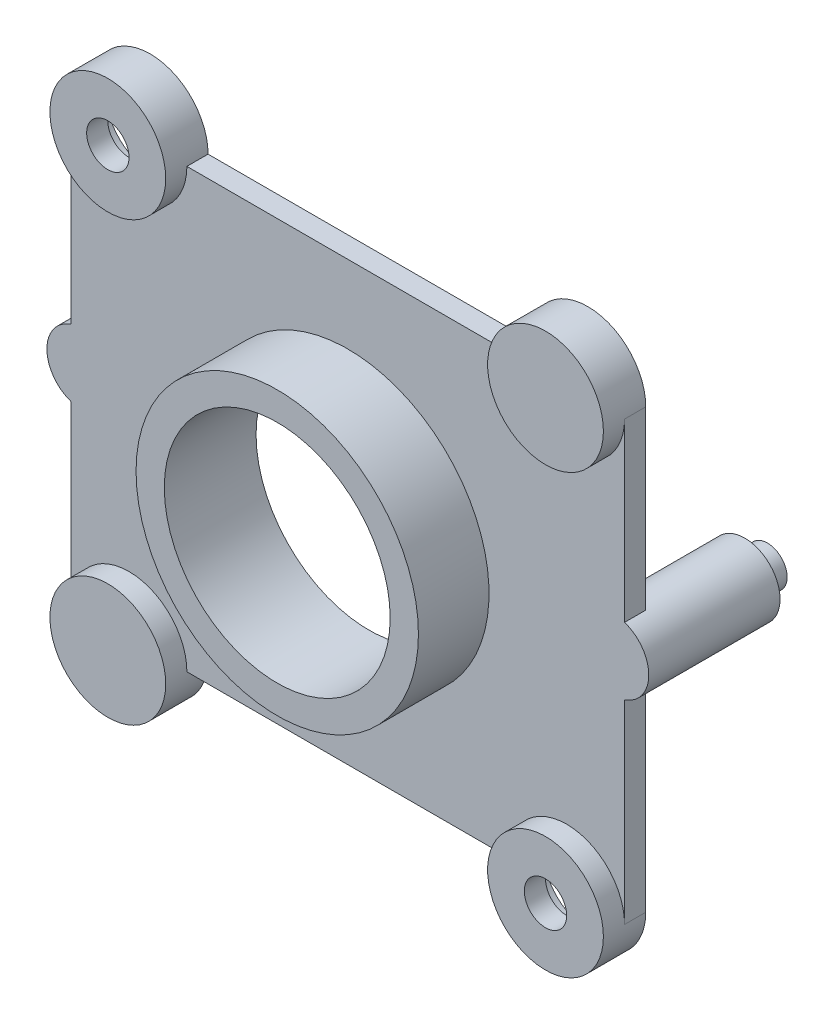
ISO-10303-21;
HEADER;
FILE_DESCRIPTION(('STEP AP214'),'2;1');
FILE_NAME('part.step','',(''),(''),'','','');
FILE_SCHEMA(('AUTOMOTIVE_DESIGN { 1 0 10303 214 1 1 1 1 }'));
ENDSEC;
DATA;
#1=APPLICATION_CONTEXT('core data for automotive mechanical design processes');
#2=APPLICATION_PROTOCOL_DEFINITION('international standard','automotive_design',2000,#1);
#3=PRODUCT_CONTEXT('',#1,'mechanical');
#4=PRODUCT('Part','Part','',(#3));
#5=PRODUCT_RELATED_PRODUCT_CATEGORY('part','',(#4));
#6=PRODUCT_DEFINITION_FORMATION('','',#4);
#7=PRODUCT_DEFINITION_CONTEXT('part definition',#1,'design');
#8=PRODUCT_DEFINITION('design','',#6,#7);
#9=PRODUCT_DEFINITION_SHAPE('','',#8);
#10=(LENGTH_UNIT() NAMED_UNIT(*) SI_UNIT(.MILLI.,.METRE.));
#11=(NAMED_UNIT(*) PLANE_ANGLE_UNIT() SI_UNIT($,.RADIAN.));
#12=(NAMED_UNIT(*) SI_UNIT($,.STERADIAN.) SOLID_ANGLE_UNIT());
#13=UNCERTAINTY_MEASURE_WITH_UNIT(LENGTH_MEASURE(1.E-05),#10,'distance_accuracy_value','');
#14=(GEOMETRIC_REPRESENTATION_CONTEXT(3) GLOBAL_UNCERTAINTY_ASSIGNED_CONTEXT((#13)) GLOBAL_UNIT_ASSIGNED_CONTEXT((#10,
#11,#12)) REPRESENTATION_CONTEXT('',''));
#15=CARTESIAN_POINT('',(0.,0.,0.));
#16=DIRECTION('',(0.,0.,1.));
#17=DIRECTION('',(1.,0.,0.));
#18=AXIS2_PLACEMENT_3D('',#15,#16,#17);
#19=CARTESIAN_POINT('',(-15.5,15.5,1.5));
#20=DIRECTION('',(0.,0.,-1.));
#21=DIRECTION('',(-1.,0.,0.));
#22=AXIS2_PLACEMENT_3D('',#19,#20,#21);
#23=PLANE('',#22);
#24=CARTESIAN_POINT('',(-15.5,-15.5,1.5));
#25=DIRECTION('',(0.,0.,1.));
#26=DIRECTION('',(1.,0.,0.));
#27=AXIS2_PLACEMENT_3D('',#24,#25,#26);
#28=CIRCLE('',#27,4.1);
#29=CARTESIAN_POINT('',(-11.4,-15.5,1.5));
#30=VERTEX_POINT('',#29);
#31=CARTESIAN_POINT('',(-19.6,-15.5,1.5));
#32=VERTEX_POINT('',#31);
#33=EDGE_CURVE('E225',#30,#32,#28,.T.);
#34=ORIENTED_EDGE('',*,*,#33,.F.);
#35=DIRECTION('',(1.,0.,0.));
#36=VECTOR('',#35,1.);
#37=CARTESIAN_POINT('',(11.4,-15.5,1.5));
#38=LINE('',#37,#36);
#39=CARTESIAN_POINT('',(11.4,-15.5,1.5));
#40=VERTEX_POINT('',#39);
#41=EDGE_CURVE('E298',#30,#40,#38,.T.);
#42=ORIENTED_EDGE('',*,*,#41,.T.);
#43=CARTESIAN_POINT('',(15.5,-15.5,1.5));
#44=DIRECTION('',(0.,0.,1.));
#45=DIRECTION('',(1.,0.,0.));
#46=AXIS2_PLACEMENT_3D('',#43,#44,#45);
#47=CIRCLE('',#46,4.1);
#48=CARTESIAN_POINT('',(19.6,-15.5,1.5));
#49=VERTEX_POINT('',#48);
#50=EDGE_CURVE('E231',#49,#40,#47,.T.);
#51=ORIENTED_EDGE('',*,*,#50,.F.);
#52=DIRECTION('',(0.,1.,0.));
#53=VECTOR('',#52,1.);
#54=CARTESIAN_POINT('',(19.6,-15.5,1.5));
#55=LINE('',#54,#53);
#56=CARTESIAN_POINT('',(19.6,-1.71605864665475,1.5));
#57=VERTEX_POINT('',#56);
#58=EDGE_CURVE('E300',#49,#57,#55,.T.);
#59=ORIENTED_EDGE('',*,*,#58,.T.);
#60=CARTESIAN_POINT('',(18.8134315520562,0.656979506578192,1.5));
#61=DIRECTION('',(0.,0.,1.));
#62=DIRECTION('',(-1.,0.,0.));
#63=AXIS2_PLACEMENT_3D('',#60,#61,#62);
#64=CIRCLE('',#63,2.5);
#65=CARTESIAN_POINT('',(19.6,3.03001765981114,1.5));
#66=VERTEX_POINT('',#65);
#67=EDGE_CURVE('E173',#57,#66,#64,.T.);
#68=ORIENTED_EDGE('',*,*,#67,.T.);
#69=DIRECTION('',(0.,1.,0.));
#70=VECTOR('',#69,1.);
#71=CARTESIAN_POINT('',(19.6,15.5,1.5));
#72=LINE('',#71,#70);
#73=CARTESIAN_POINT('',(19.6,15.5,1.5));
#74=VERTEX_POINT('',#73);
#75=EDGE_CURVE('E303',#66,#74,#72,.T.);
#76=ORIENTED_EDGE('',*,*,#75,.T.);
#77=CARTESIAN_POINT('',(15.5,15.5,1.5));
#78=DIRECTION('',(0.,0.,1.));
#79=DIRECTION('',(1.,0.,0.));
#80=AXIS2_PLACEMENT_3D('',#77,#78,#79);
#81=CIRCLE('',#80,4.1);
#82=CARTESIAN_POINT('',(11.4,15.5,1.5));
#83=VERTEX_POINT('',#82);
#84=EDGE_CURVE('E242',#83,#74,#81,.T.);
#85=ORIENTED_EDGE('',*,*,#84,.F.);
#86=DIRECTION('',(-1.,0.,0.));
#87=VECTOR('',#86,1.);
#88=CARTESIAN_POINT('',(-11.4,15.5,1.5));
#89=LINE('',#88,#87);
#90=CARTESIAN_POINT('',(-11.4,15.5,1.5));
#91=VERTEX_POINT('',#90);
#92=EDGE_CURVE('E305',#83,#91,#89,.T.);
#93=ORIENTED_EDGE('',*,*,#92,.T.);
#94=CARTESIAN_POINT('',(-15.5,15.5,1.5));
#95=DIRECTION('',(0.,0.,1.));
#96=DIRECTION('',(1.,0.,0.));
#97=AXIS2_PLACEMENT_3D('',#94,#95,#96);
#98=CIRCLE('',#97,4.1);
#99=CARTESIAN_POINT('',(-19.6,15.5,1.5));
#100=VERTEX_POINT('',#99);
#101=EDGE_CURVE('E38',#100,#91,#98,.T.);
#102=ORIENTED_EDGE('',*,*,#101,.F.);
#103=DIRECTION('',(0.,-1.,0.));
#104=VECTOR('',#103,1.);
#105=CARTESIAN_POINT('',(-19.6,15.5,1.5));
#106=LINE('',#105,#104);
#107=CARTESIAN_POINT('',(-19.6,1.71605864665475,1.5));
#108=VERTEX_POINT('',#107);
#109=EDGE_CURVE('E202',#100,#108,#106,.T.);
#110=ORIENTED_EDGE('',*,*,#109,.T.);
#111=CARTESIAN_POINT('',(-18.8134315520562,-0.65697950657819,1.5));
#112=DIRECTION('',(0.,0.,1.));
#113=DIRECTION('',(1.,0.,0.));
#114=AXIS2_PLACEMENT_3D('',#111,#112,#113);
#115=CIRCLE('',#114,2.5);
#116=CARTESIAN_POINT('',(-19.6,-3.03001765981113,1.5));
#117=VERTEX_POINT('',#116);
#118=EDGE_CURVE('E204',#108,#117,#115,.T.);
#119=ORIENTED_EDGE('',*,*,#118,.T.);
#120=DIRECTION('',(0.,-1.,0.));
#121=VECTOR('',#120,1.);
#122=CARTESIAN_POINT('',(-19.6,-15.5,1.5));
#123=LINE('',#122,#121);
#124=EDGE_CURVE('E296',#117,#32,#123,.T.);
#125=ORIENTED_EDGE('',*,*,#124,.T.);
#126=EDGE_LOOP('',(#34,#42,#51,#59,#68,#76,#85,#93,#102,#110,#119,#125));
#127=FACE_BOUND('',#126,.T.);
#128=CARTESIAN_POINT('',(0.,0.,1.5));
#129=DIRECTION('',(0.,0.,-1.));
#130=DIRECTION('',(-1.,0.,0.));
#131=AXIS2_PLACEMENT_3D('',#128,#129,#130);
#132=CIRCLE('',#131,10.);
#133=CARTESIAN_POINT('',(-10.,0.,1.5));
#134=VERTEX_POINT('',#133);
#135=EDGE_CURVE('E11',#134,#134,#132,.F.);
#136=ORIENTED_EDGE('',*,*,#135,.F.);
#137=EDGE_LOOP('',(#136));
#138=FACE_BOUND('',#137,.T.);
#139=ADVANCED_FACE('F30',(#127,#138),#23,.F.);
#140=CARTESIAN_POINT('',(-18.8134315520562,-0.65697950657819,-7.8));
#141=DIRECTION('',(0.,0.,-1.));
#142=DIRECTION('',(-1.,0.,0.));
#143=AXIS2_PLACEMENT_3D('',#140,#141,#142);
#144=PLANE('',#143);
#145=CARTESIAN_POINT('',(-18.8134315520562,-0.65697950657819,-7.8));
#146=DIRECTION('',(0.,0.,-1.));
#147=DIRECTION('',(-1.,0.,0.));
#148=AXIS2_PLACEMENT_3D('',#145,#146,#147);
#149=CIRCLE('',#148,2.5);
#150=CARTESIAN_POINT('',(-21.3134315520562,-0.65697950657819,-7.8));
#151=VERTEX_POINT('',#150);
#152=EDGE_CURVE('E220',#151,#151,#149,.T.);
#153=ORIENTED_EDGE('',*,*,#152,.T.);
#154=EDGE_LOOP('',(#153));
#155=FACE_BOUND('',#154,.T.);
#156=CARTESIAN_POINT('',(-18.8134315520562,-0.65697950657819,-7.8));
#157=DIRECTION('',(0.,0.,-1.));
#158=DIRECTION('',(-1.,0.,0.));
#159=AXIS2_PLACEMENT_3D('',#156,#157,#158);
#160=CIRCLE('',#159,1.4);
#161=CARTESIAN_POINT('',(-20.2134315520562,-0.65697950657819,-7.8));
#162=VERTEX_POINT('',#161);
#163=EDGE_CURVE('E489',#162,#162,#160,.T.);
#164=ORIENTED_EDGE('',*,*,#163,.F.);
#165=EDGE_LOOP('',(#164));
#166=FACE_BOUND('',#165,.T.);
#167=ADVANCED_FACE('F354',(#155,#166),#144,.T.);
#168=CARTESIAN_POINT('',(18.8134315520562,0.656979506578192,-7.8));
#169=DIRECTION('',(0.,0.,-1.));
#170=DIRECTION('',(-1.,0.,0.));
#171=AXIS2_PLACEMENT_3D('',#168,#169,#170);
#172=PLANE('',#171);
#173=CARTESIAN_POINT('',(18.8134315520562,0.656979506578192,-7.8));
#174=DIRECTION('',(0.,0.,-1.));
#175=DIRECTION('',(-1.,0.,0.));
#176=AXIS2_PLACEMENT_3D('',#173,#174,#175);
#177=CIRCLE('',#176,2.5);
#178=CARTESIAN_POINT('',(16.3134315520562,0.656979506578192,-7.8));
#179=VERTEX_POINT('',#178);
#180=EDGE_CURVE('E158',#179,#179,#177,.T.);
#181=ORIENTED_EDGE('',*,*,#180,.T.);
#182=EDGE_LOOP('',(#181));
#183=FACE_BOUND('',#182,.T.);
#184=CARTESIAN_POINT('',(18.8134315520562,0.656979506578192,-7.8));
#185=DIRECTION('',(0.,0.,-1.));
#186=DIRECTION('',(-1.,0.,0.));
#187=AXIS2_PLACEMENT_3D('',#184,#185,#186);
#188=CIRCLE('',#187,1.4);
#189=CARTESIAN_POINT('',(17.4134315520562,0.656979506578192,-7.8));
#190=VERTEX_POINT('',#189);
#191=EDGE_CURVE('E493',#190,#190,#188,.T.);
#192=ORIENTED_EDGE('',*,*,#191,.F.);
#193=EDGE_LOOP('',(#192));
#194=FACE_BOUND('',#193,.T.);
#195=ADVANCED_FACE('F359',(#183,#194),#172,.T.);
#196=CARTESIAN_POINT('',(-15.5,15.5,0.));
#197=DIRECTION('',(0.,0.,-1.));
#198=DIRECTION('',(-1.,0.,0.));
#199=AXIS2_PLACEMENT_3D('',#196,#197,#198);
#200=PLANE('',#199);
#201=CARTESIAN_POINT('',(0.,0.,0.));
#202=DIRECTION('',(0.,0.,-1.));
#203=DIRECTION('',(-1.,0.,0.));
#204=AXIS2_PLACEMENT_3D('',#201,#202,#203);
#205=CIRCLE('',#204,8.);
#206=CARTESIAN_POINT('',(-8.,0.,0.));
#207=VERTEX_POINT('',#206);
#208=EDGE_CURVE('E484',#207,#207,#205,.T.);
#209=ORIENTED_EDGE('',*,*,#208,.F.);
#210=EDGE_LOOP('',(#209));
#211=FACE_BOUND('',#210,.T.);
#212=DIRECTION('',(1.,0.,0.));
#213=VECTOR('',#212,1.);
#214=CARTESIAN_POINT('',(18.5935416596516,15.3,0.));
#215=LINE('',#214,#213);
#216=CARTESIAN_POINT('',(12.4064583403484,15.3,0.));
#217=VERTEX_POINT('',#216);
#218=CARTESIAN_POINT('',(18.5935416596516,15.3,0.));
#219=VERTEX_POINT('',#218);
#220=EDGE_CURVE('E262',#217,#219,#215,.T.);
#221=ORIENTED_EDGE('',*,*,#220,.T.);
#222=CARTESIAN_POINT('',(15.5,15.5,0.));
#223=DIRECTION('',(0.,0.,1.));
#224=DIRECTION('',(1.,0.,0.));
#225=AXIS2_PLACEMENT_3D('',#222,#223,#224);
#226=CIRCLE('',#225,3.1);
#227=EDGE_CURVE('E45',#219,#217,#226,.T.);
#228=ORIENTED_EDGE('',*,*,#227,.T.);
#229=EDGE_LOOP('',(#221,#228));
#230=FACE_BOUND('',#229,.T.);
#231=DIRECTION('',(-1.,0.,0.));
#232=VECTOR('',#231,1.);
#233=CARTESIAN_POINT('',(-12.4064583403484,-15.3,0.));
#234=LINE('',#233,#232);
#235=CARTESIAN_POINT('',(-12.4064583403484,-15.3,0.));
#236=VERTEX_POINT('',#235);
#237=CARTESIAN_POINT('',(-18.5935416596516,-15.3,0.));
#238=VERTEX_POINT('',#237);
#239=EDGE_CURVE('E281',#236,#238,#234,.T.);
#240=ORIENTED_EDGE('',*,*,#239,.T.);
#241=CARTESIAN_POINT('',(-15.5,-15.5,0.));
#242=DIRECTION('',(0.,0.,1.));
#243=DIRECTION('',(-1.,0.,0.));
#244=AXIS2_PLACEMENT_3D('',#241,#242,#243);
#245=CIRCLE('',#244,3.1);
#246=EDGE_CURVE('E53',#238,#236,#245,.T.);
#247=ORIENTED_EDGE('',*,*,#246,.T.);
#248=EDGE_LOOP('',(#240,#247));
#249=FACE_BOUND('',#248,.T.);
#250=CARTESIAN_POINT('',(15.5,-15.5,0.));
#251=DIRECTION('',(0.,0.,1.));
#252=DIRECTION('',(1.,0.,0.));
#253=AXIS2_PLACEMENT_3D('',#250,#251,#252);
#254=CIRCLE('',#253,3.1);
#255=CARTESIAN_POINT('',(18.6,-15.5,0.));
#256=VERTEX_POINT('',#255);
#257=EDGE_CURVE('E291',#256,#256,#254,.T.);
#258=ORIENTED_EDGE('',*,*,#257,.T.);
#259=EDGE_LOOP('',(#258));
#260=FACE_BOUND('',#259,.T.);
#261=CARTESIAN_POINT('',(-15.5,15.5,0.));
#262=DIRECTION('',(0.,0.,1.));
#263=DIRECTION('',(1.,0.,0.));
#264=AXIS2_PLACEMENT_3D('',#261,#262,#263);
#265=CIRCLE('',#264,3.1);
#266=CARTESIAN_POINT('',(-12.4,15.5,0.));
#267=VERTEX_POINT('',#266);
#268=EDGE_CURVE('E272',#267,#267,#265,.T.);
#269=ORIENTED_EDGE('',*,*,#268,.T.);
#270=EDGE_LOOP('',(#269));
#271=FACE_BOUND('',#270,.T.);
#272=DIRECTION('',(0.,1.,0.));
#273=VECTOR('',#272,1.);
#274=CARTESIAN_POINT('',(19.6,15.5,0.));
#275=LINE('',#274,#273);
#276=CARTESIAN_POINT('',(19.6,3.03001765981114,0.));
#277=VERTEX_POINT('',#276);
#278=CARTESIAN_POINT('',(19.6,15.5,0.));
#279=VERTEX_POINT('',#278);
#280=EDGE_CURVE('E153',#277,#279,#275,.T.);
#281=ORIENTED_EDGE('',*,*,#280,.F.);
#282=CARTESIAN_POINT('',(18.8134315520562,0.656979506578192,0.));
#283=DIRECTION('',(0.,0.,-1.));
#284=DIRECTION('',(-1.,0.,0.));
#285=AXIS2_PLACEMENT_3D('',#282,#283,#284);
#286=CIRCLE('',#285,2.5);
#287=CARTESIAN_POINT('',(19.6,-1.71605864665475,0.));
#288=VERTEX_POINT('',#287);
#289=EDGE_CURVE('E147',#288,#277,#286,.T.);
#290=ORIENTED_EDGE('',*,*,#289,.F.);
#291=DIRECTION('',(0.,1.,0.));
#292=VECTOR('',#291,1.);
#293=CARTESIAN_POINT('',(19.6,-15.5,0.));
#294=LINE('',#293,#292);
#295=CARTESIAN_POINT('',(19.6,-15.5,0.));
#296=VERTEX_POINT('',#295);
#297=EDGE_CURVE('E151',#296,#288,#294,.T.);
#298=ORIENTED_EDGE('',*,*,#297,.F.);
#299=CARTESIAN_POINT('',(15.5,-15.5,0.));
#300=DIRECTION('',(0.,0.,1.));
#301=DIRECTION('',(-1.,0.,0.));
#302=AXIS2_PLACEMENT_3D('',#299,#300,#301);
#303=CIRCLE('',#302,4.1);
#304=CARTESIAN_POINT('',(11.4,-15.5,0.));
#305=VERTEX_POINT('',#304);
#306=EDGE_CURVE('E169',#305,#296,#303,.T.);
#307=ORIENTED_EDGE('',*,*,#306,.F.);
#308=DIRECTION('',(1.,0.,0.));
#309=VECTOR('',#308,1.);
#310=CARTESIAN_POINT('',(11.4,-15.5,0.));
#311=LINE('',#310,#309);
#312=CARTESIAN_POINT('',(-11.4,-15.5,0.));
#313=VERTEX_POINT('',#312);
#314=EDGE_CURVE('E311',#313,#305,#311,.T.);
#315=ORIENTED_EDGE('',*,*,#314,.F.);
#316=CARTESIAN_POINT('',(-15.5,-15.5,0.));
#317=DIRECTION('',(0.,0.,1.));
#318=DIRECTION('',(-1.,0.,0.));
#319=AXIS2_PLACEMENT_3D('',#316,#317,#318);
#320=CIRCLE('',#319,4.1);
#321=CARTESIAN_POINT('',(-19.6,-15.5,0.));
#322=VERTEX_POINT('',#321);
#323=EDGE_CURVE('E309',#322,#313,#320,.T.);
#324=ORIENTED_EDGE('',*,*,#323,.F.);
#325=DIRECTION('',(0.,-1.,0.));
#326=VECTOR('',#325,1.);
#327=CARTESIAN_POINT('',(-19.6,-15.5,0.));
#328=LINE('',#327,#326);
#329=CARTESIAN_POINT('',(-19.6,-3.03001765981113,0.));
#330=VERTEX_POINT('',#329);
#331=EDGE_CURVE('E312',#330,#322,#328,.T.);
#332=ORIENTED_EDGE('',*,*,#331,.F.);
#333=CARTESIAN_POINT('',(-18.8134315520562,-0.65697950657819,0.));
#334=DIRECTION('',(0.,0.,-1.));
#335=DIRECTION('',(-1.,0.,0.));
#336=AXIS2_PLACEMENT_3D('',#333,#334,#335);
#337=CIRCLE('',#336,2.5);
#338=CARTESIAN_POINT('',(-19.6,1.71605864665475,0.));
#339=VERTEX_POINT('',#338);
#340=EDGE_CURVE('E217',#339,#330,#337,.T.);
#341=ORIENTED_EDGE('',*,*,#340,.F.);
#342=DIRECTION('',(0.,-1.,0.));
#343=VECTOR('',#342,1.);
#344=CARTESIAN_POINT('',(-19.6,15.5,0.));
#345=LINE('',#344,#343);
#346=CARTESIAN_POINT('',(-19.6,15.5,0.));
#347=VERTEX_POINT('',#346);
#348=EDGE_CURVE('E308',#347,#339,#345,.T.);
#349=ORIENTED_EDGE('',*,*,#348,.F.);
#350=CARTESIAN_POINT('',(-15.5,15.5,0.));
#351=DIRECTION('',(0.,0.,1.));
#352=DIRECTION('',(-1.,0.,0.));
#353=AXIS2_PLACEMENT_3D('',#350,#351,#352);
#354=CIRCLE('',#353,4.1);
#355=CARTESIAN_POINT('',(-11.4,15.5,0.));
#356=VERTEX_POINT('',#355);
#357=EDGE_CURVE('E294',#356,#347,#354,.T.);
#358=ORIENTED_EDGE('',*,*,#357,.F.);
#359=DIRECTION('',(-1.,0.,0.));
#360=VECTOR('',#359,1.);
#361=CARTESIAN_POINT('',(-11.4,15.5,0.));
#362=LINE('',#361,#360);
#363=CARTESIAN_POINT('',(11.4,15.5,0.));
#364=VERTEX_POINT('',#363);
#365=EDGE_CURVE('E205',#364,#356,#362,.T.);
#366=ORIENTED_EDGE('',*,*,#365,.F.);
#367=CARTESIAN_POINT('',(15.5,15.5,0.));
#368=DIRECTION('',(0.,0.,1.));
#369=DIRECTION('',(-1.,0.,0.));
#370=AXIS2_PLACEMENT_3D('',#367,#368,#369);
#371=CIRCLE('',#370,4.1);
#372=EDGE_CURVE('E316',#279,#364,#371,.T.);
#373=ORIENTED_EDGE('',*,*,#372,.F.);
#374=EDGE_LOOP('',(#281,#290,#298,#307,#315,#324,#332,#341,#349,#358,#366,#373));
#375=FACE_BOUND('',#374,.T.);
#376=ADVANCED_FACE('F149',(#211,#230,#249,#260,#271,#375),#200,.T.);
#377=CARTESIAN_POINT('',(-15.5,15.5,1.5));
#378=DIRECTION('',(0.,0.,-1.));
#379=DIRECTION('',(-1.,0.,0.));
#380=AXIS2_PLACEMENT_3D('',#377,#378,#379);
#381=CYLINDRICAL_SURFACE('',#380,4.1);
#382=ORIENTED_EDGE('',*,*,#357,.T.);
#383=DIRECTION('',(0.,0.,-1.));
#384=VECTOR('',#383,1.);
#385=CARTESIAN_POINT('',(-19.6,15.5,1.5));
#386=LINE('',#385,#384);
#387=EDGE_CURVE('E199',#100,#347,#386,.T.);
#388=ORIENTED_EDGE('',*,*,#387,.F.);
#389=ORIENTED_EDGE('',*,*,#101,.T.);
#390=DIRECTION('',(0.,0.,-1.));
#391=VECTOR('',#390,1.);
#392=CARTESIAN_POINT('',(-11.4,15.5,1.5));
#393=LINE('',#392,#391);
#394=EDGE_CURVE('E193',#91,#356,#393,.T.);
#395=ORIENTED_EDGE('',*,*,#394,.T.);
#396=EDGE_LOOP('',(#382,#388,#389,#395));
#397=FACE_BOUND('',#396,.T.);
#398=CARTESIAN_POINT('',(-15.5,15.5,3.));
#399=DIRECTION('',(0.,0.,1.));
#400=DIRECTION('',(1.,0.,0.));
#401=AXIS2_PLACEMENT_3D('',#398,#399,#400);
#402=CIRCLE('',#401,4.1);
#403=CARTESIAN_POINT('',(-11.4,15.5,3.));
#404=VERTEX_POINT('',#403);
#405=EDGE_CURVE('E252',#404,#404,#402,.T.);
#406=ORIENTED_EDGE('',*,*,#405,.F.);
#407=EDGE_LOOP('',(#406));
#408=FACE_BOUND('',#407,.T.);
#409=ADVANCED_FACE('F32',(#397,#408),#381,.T.);
#410=CARTESIAN_POINT('',(-19.6,15.5,1.5));
#411=DIRECTION('',(1.,0.,0.));
#412=DIRECTION('',(0.,0.,-1.));
#413=AXIS2_PLACEMENT_3D('',#410,#411,#412);
#414=PLANE('',#413);
#415=ORIENTED_EDGE('',*,*,#348,.T.);
#416=DIRECTION('',(0.,0.,-1.));
#417=VECTOR('',#416,1.);
#418=CARTESIAN_POINT('',(-19.6,1.71605864665475,1.5));
#419=LINE('',#418,#417);
#420=EDGE_CURVE('E210',#108,#339,#419,.T.);
#421=ORIENTED_EDGE('',*,*,#420,.F.);
#422=ORIENTED_EDGE('',*,*,#109,.F.);
#423=ORIENTED_EDGE('',*,*,#387,.T.);
#424=EDGE_LOOP('',(#415,#421,#422,#423));
#425=FACE_BOUND('',#424,.T.);
#426=ADVANCED_FACE('F627',(#425),#414,.F.);
#427=CARTESIAN_POINT('',(-18.8134315520562,-0.65697950657819,1.5));
#428=DIRECTION('',(0.,0.,-1.));
#429=DIRECTION('',(-1.,0.,0.));
#430=AXIS2_PLACEMENT_3D('',#427,#428,#429);
#431=CYLINDRICAL_SURFACE('',#430,2.5);
#432=ORIENTED_EDGE('',*,*,#420,.T.);
#433=ORIENTED_EDGE('',*,*,#340,.T.);
#434=DIRECTION('',(0.,0.,-1.));
#435=VECTOR('',#434,1.);
#436=CARTESIAN_POINT('',(-19.6,-3.03001765981113,1.5));
#437=LINE('',#436,#435);
#438=EDGE_CURVE('E190',#117,#330,#437,.T.);
#439=ORIENTED_EDGE('',*,*,#438,.F.);
#440=ORIENTED_EDGE('',*,*,#118,.F.);
#441=EDGE_LOOP('',(#432,#433,#439,#440));
#442=FACE_BOUND('',#441,.T.);
#443=ORIENTED_EDGE('',*,*,#152,.F.);
#444=EDGE_LOOP('',(#443));
#445=FACE_BOUND('',#444,.T.);
#446=ADVANCED_FACE('F615',(#442,#445),#431,.T.);
#447=CARTESIAN_POINT('',(-19.6,-15.5,1.5));
#448=DIRECTION('',(1.,0.,0.));
#449=DIRECTION('',(0.,1.,0.));
#450=AXIS2_PLACEMENT_3D('',#447,#448,#449);
#451=PLANE('',#450);
#452=ORIENTED_EDGE('',*,*,#331,.T.);
#453=DIRECTION('',(0.,0.,-1.));
#454=VECTOR('',#453,1.);
#455=CARTESIAN_POINT('',(-19.6,-15.5,1.5));
#456=LINE('',#455,#454);
#457=EDGE_CURVE('E187',#32,#322,#456,.T.);
#458=ORIENTED_EDGE('',*,*,#457,.F.);
#459=ORIENTED_EDGE('',*,*,#124,.F.);
#460=ORIENTED_EDGE('',*,*,#438,.T.);
#461=EDGE_LOOP('',(#452,#458,#459,#460));
#462=FACE_BOUND('',#461,.T.);
#463=ADVANCED_FACE('F609',(#462),#451,.F.);
#464=CARTESIAN_POINT('',(-15.5,-15.5,1.5));
#465=DIRECTION('',(0.,0.,-1.));
#466=DIRECTION('',(-1.,0.,0.));
#467=AXIS2_PLACEMENT_3D('',#464,#465,#466);
#468=CYLINDRICAL_SURFACE('',#467,4.1);
#469=ORIENTED_EDGE('',*,*,#323,.T.);
#470=DIRECTION('',(0.,0.,-1.));
#471=VECTOR('',#470,1.);
#472=CARTESIAN_POINT('',(-11.4,-15.5,1.5));
#473=LINE('',#472,#471);
#474=EDGE_CURVE('E184',#30,#313,#473,.T.);
#475=ORIENTED_EDGE('',*,*,#474,.F.);
#476=ORIENTED_EDGE('',*,*,#33,.T.);
#477=ORIENTED_EDGE('',*,*,#457,.T.);
#478=EDGE_LOOP('',(#469,#475,#476,#477));
#479=FACE_BOUND('',#478,.T.);
#480=CARTESIAN_POINT('',(-15.5,-15.5,3.));
#481=DIRECTION('',(0.,0.,1.));
#482=DIRECTION('',(1.,0.,0.));
#483=AXIS2_PLACEMENT_3D('',#480,#481,#482);
#484=CIRCLE('',#483,4.1);
#485=CARTESIAN_POINT('',(-11.4,-15.5,3.));
#486=VERTEX_POINT('',#485);
#487=EDGE_CURVE('E221',#486,#486,#484,.T.);
#488=ORIENTED_EDGE('',*,*,#487,.F.);
#489=EDGE_LOOP('',(#488));
#490=FACE_BOUND('',#489,.T.);
#491=ADVANCED_FACE('F614',(#479,#490),#468,.T.);
#492=CARTESIAN_POINT('',(11.4,-15.5,1.5));
#493=DIRECTION('',(0.,1.,0.));
#494=DIRECTION('',(0.,0.,1.));
#495=AXIS2_PLACEMENT_3D('',#492,#493,#494);
#496=PLANE('',#495);
#497=ORIENTED_EDGE('',*,*,#314,.T.);
#498=DIRECTION('',(0.,0.,-1.));
#499=VECTOR('',#498,1.);
#500=CARTESIAN_POINT('',(11.4,-15.5,1.5));
#501=LINE('',#500,#499);
#502=EDGE_CURVE('E176',#40,#305,#501,.T.);
#503=ORIENTED_EDGE('',*,*,#502,.F.);
#504=ORIENTED_EDGE('',*,*,#41,.F.);
#505=ORIENTED_EDGE('',*,*,#474,.T.);
#506=EDGE_LOOP('',(#497,#503,#504,#505));
#507=FACE_BOUND('',#506,.T.);
#508=ADVANCED_FACE('F741',(#507),#496,.F.);
#509=CARTESIAN_POINT('',(15.5,-15.5,1.5));
#510=DIRECTION('',(0.,0.,-1.));
#511=DIRECTION('',(-1.,0.,0.));
#512=AXIS2_PLACEMENT_3D('',#509,#510,#511);
#513=CYLINDRICAL_SURFACE('',#512,4.1);
#514=ORIENTED_EDGE('',*,*,#306,.T.);
#515=DIRECTION('',(0.,0.,-1.));
#516=VECTOR('',#515,1.);
#517=CARTESIAN_POINT('',(19.6,-15.5,1.5));
#518=LINE('',#517,#516);
#519=EDGE_CURVE('E168',#49,#296,#518,.T.);
#520=ORIENTED_EDGE('',*,*,#519,.F.);
#521=ORIENTED_EDGE('',*,*,#50,.T.);
#522=ORIENTED_EDGE('',*,*,#502,.T.);
#523=EDGE_LOOP('',(#514,#520,#521,#522));
#524=FACE_BOUND('',#523,.T.);
#525=CARTESIAN_POINT('',(15.5,-15.5,3.));
#526=DIRECTION('',(0.,0.,1.));
#527=DIRECTION('',(1.,0.,0.));
#528=AXIS2_PLACEMENT_3D('',#525,#526,#527);
#529=CIRCLE('',#528,4.1);
#530=CARTESIAN_POINT('',(19.6,-15.5,3.));
#531=VERTEX_POINT('',#530);
#532=EDGE_CURVE('E234',#531,#531,#529,.T.);
#533=ORIENTED_EDGE('',*,*,#532,.F.);
#534=EDGE_LOOP('',(#533));
#535=FACE_BOUND('',#534,.T.);
#536=ADVANCED_FACE('F602',(#524,#535),#513,.T.);
#537=CARTESIAN_POINT('',(19.6,-15.5,1.5));
#538=DIRECTION('',(-1.,0.,0.));
#539=DIRECTION('',(0.,-1.,0.));
#540=AXIS2_PLACEMENT_3D('',#537,#538,#539);
#541=PLANE('',#540);
#542=ORIENTED_EDGE('',*,*,#297,.T.);
#543=DIRECTION('',(0.,0.,-1.));
#544=VECTOR('',#543,1.);
#545=CARTESIAN_POINT('',(19.6,-1.71605864665475,1.5));
#546=LINE('',#545,#544);
#547=EDGE_CURVE('E165',#57,#288,#546,.T.);
#548=ORIENTED_EDGE('',*,*,#547,.F.);
#549=ORIENTED_EDGE('',*,*,#58,.F.);
#550=ORIENTED_EDGE('',*,*,#519,.T.);
#551=EDGE_LOOP('',(#542,#548,#549,#550));
#552=FACE_BOUND('',#551,.T.);
#553=ADVANCED_FACE('F164',(#552),#541,.F.);
#554=CARTESIAN_POINT('',(18.8134315520562,0.656979506578192,1.5));
#555=DIRECTION('',(0.,0.,-1.));
#556=DIRECTION('',(-1.,0.,0.));
#557=AXIS2_PLACEMENT_3D('',#554,#555,#556);
#558=CYLINDRICAL_SURFACE('',#557,2.5);
#559=ORIENTED_EDGE('',*,*,#547,.T.);
#560=ORIENTED_EDGE('',*,*,#289,.T.);
#561=DIRECTION('',(0.,0.,-1.));
#562=VECTOR('',#561,1.);
#563=CARTESIAN_POINT('',(19.6,3.03001765981114,1.5));
#564=LINE('',#563,#562);
#565=EDGE_CURVE('E174',#66,#277,#564,.T.);
#566=ORIENTED_EDGE('',*,*,#565,.F.);
#567=ORIENTED_EDGE('',*,*,#67,.F.);
#568=EDGE_LOOP('',(#559,#560,#566,#567));
#569=FACE_BOUND('',#568,.T.);
#570=ORIENTED_EDGE('',*,*,#180,.F.);
#571=EDGE_LOOP('',(#570));
#572=FACE_BOUND('',#571,.T.);
#573=ADVANCED_FACE('F171',(#569,#572),#558,.T.);
#574=CARTESIAN_POINT('',(19.6,15.5,1.5));
#575=DIRECTION('',(-1.,0.,0.));
#576=DIRECTION('',(0.,-1.,0.));
#577=AXIS2_PLACEMENT_3D('',#574,#575,#576);
#578=PLANE('',#577);
#579=ORIENTED_EDGE('',*,*,#280,.T.);
#580=DIRECTION('',(0.,0.,-1.));
#581=VECTOR('',#580,1.);
#582=CARTESIAN_POINT('',(19.6,15.5,1.5));
#583=LINE('',#582,#581);
#584=EDGE_CURVE('E178',#74,#279,#583,.T.);
#585=ORIENTED_EDGE('',*,*,#584,.F.);
#586=ORIENTED_EDGE('',*,*,#75,.F.);
#587=ORIENTED_EDGE('',*,*,#565,.T.);
#588=EDGE_LOOP('',(#579,#585,#586,#587));
#589=FACE_BOUND('',#588,.T.);
#590=ADVANCED_FACE('F344',(#589),#578,.F.);
#591=CARTESIAN_POINT('',(15.5,15.5,1.5));
#592=DIRECTION('',(0.,0.,-1.));
#593=DIRECTION('',(-1.,0.,0.));
#594=AXIS2_PLACEMENT_3D('',#591,#592,#593);
#595=CYLINDRICAL_SURFACE('',#594,4.1);
#596=ORIENTED_EDGE('',*,*,#372,.T.);
#597=DIRECTION('',(0.,0.,-1.));
#598=VECTOR('',#597,1.);
#599=CARTESIAN_POINT('',(11.4,15.5,1.5));
#600=LINE('',#599,#598);
#601=EDGE_CURVE('E319',#83,#364,#600,.T.);
#602=ORIENTED_EDGE('',*,*,#601,.F.);
#603=ORIENTED_EDGE('',*,*,#84,.T.);
#604=ORIENTED_EDGE('',*,*,#584,.T.);
#605=EDGE_LOOP('',(#596,#602,#603,#604));
#606=FACE_BOUND('',#605,.T.);
#607=CARTESIAN_POINT('',(15.5,15.5,3.));
#608=DIRECTION('',(0.,0.,1.));
#609=DIRECTION('',(1.,0.,0.));
#610=AXIS2_PLACEMENT_3D('',#607,#608,#609);
#611=CIRCLE('',#610,4.1);
#612=CARTESIAN_POINT('',(19.6,15.5,3.));
#613=VERTEX_POINT('',#612);
#614=EDGE_CURVE('E243',#613,#613,#611,.T.);
#615=ORIENTED_EDGE('',*,*,#614,.F.);
#616=EDGE_LOOP('',(#615));
#617=FACE_BOUND('',#616,.T.);
#618=ADVANCED_FACE('F324',(#606,#617),#595,.T.);
#619=CARTESIAN_POINT('',(-11.4,15.5,1.5));
#620=DIRECTION('',(0.,-1.,0.));
#621=DIRECTION('',(0.,0.,-1.));
#622=AXIS2_PLACEMENT_3D('',#619,#620,#621);
#623=PLANE('',#622);
#624=ORIENTED_EDGE('',*,*,#365,.T.);
#625=ORIENTED_EDGE('',*,*,#394,.F.);
#626=ORIENTED_EDGE('',*,*,#92,.F.);
#627=ORIENTED_EDGE('',*,*,#601,.T.);
#628=EDGE_LOOP('',(#624,#625,#626,#627));
#629=FACE_BOUND('',#628,.T.);
#630=ADVANCED_FACE('F334',(#629),#623,.F.);
#631=CARTESIAN_POINT('',(15.5,-15.5,1.5));
#632=DIRECTION('',(0.,0.,-1.));
#633=DIRECTION('',(-1.,0.,0.));
#634=AXIS2_PLACEMENT_3D('',#631,#632,#633);
#635=CYLINDRICAL_SURFACE('',#634,3.1);
#636=CARTESIAN_POINT('',(15.5,-15.5,1.5));
#637=DIRECTION('',(0.,0.,1.));
#638=DIRECTION('',(1.,0.,0.));
#639=AXIS2_PLACEMENT_3D('',#636,#637,#638);
#640=CIRCLE('',#639,3.1);
#641=CARTESIAN_POINT('',(18.6,-15.5,1.5));
#642=VERTEX_POINT('',#641);
#643=EDGE_CURVE('E237',#642,#642,#640,.T.);
#644=ORIENTED_EDGE('',*,*,#643,.T.);
#645=EDGE_LOOP('',(#644));
#646=FACE_BOUND('',#645,.T.);
#647=ORIENTED_EDGE('',*,*,#257,.F.);
#648=EDGE_LOOP('',(#647));
#649=FACE_BOUND('',#648,.T.);
#650=ADVANCED_FACE('F364',(#646,#649),#635,.F.);
#651=CARTESIAN_POINT('',(-15.5,-15.5,1.5));
#652=DIRECTION('',(0.,0.,-1.));
#653=DIRECTION('',(-1.,0.,0.));
#654=AXIS2_PLACEMENT_3D('',#651,#652,#653);
#655=CYLINDRICAL_SURFACE('',#654,3.1);
#656=ORIENTED_EDGE('',*,*,#246,.F.);
#657=DIRECTION('',(0.,0.,-1.));
#658=VECTOR('',#657,1.);
#659=CARTESIAN_POINT('',(-18.5935416596516,-15.3,1.5));
#660=LINE('',#659,#658);
#661=CARTESIAN_POINT('',(-18.5935416596516,-15.3,1.5));
#662=VERTEX_POINT('',#661);
#663=EDGE_CURVE('E284',#662,#238,#660,.T.);
#664=ORIENTED_EDGE('',*,*,#663,.F.);
#665=CARTESIAN_POINT('',(-15.5,-15.5,1.5));
#666=DIRECTION('',(0.,0.,1.));
#667=DIRECTION('',(-1.,0.,0.));
#668=AXIS2_PLACEMENT_3D('',#665,#666,#667);
#669=CIRCLE('',#668,3.1);
#670=CARTESIAN_POINT('',(-12.4064583403484,-15.3,1.5));
#671=VERTEX_POINT('',#670);
#672=EDGE_CURVE('E277',#662,#671,#669,.T.);
#673=ORIENTED_EDGE('',*,*,#672,.T.);
#674=DIRECTION('',(0.,0.,-1.));
#675=VECTOR('',#674,1.);
#676=CARTESIAN_POINT('',(-12.4064583403484,-15.3,1.5));
#677=LINE('',#676,#675);
#678=EDGE_CURVE('E289',#671,#236,#677,.T.);
#679=ORIENTED_EDGE('',*,*,#678,.T.);
#680=EDGE_LOOP('',(#656,#664,#673,#679));
#681=FACE_BOUND('',#680,.T.);
#682=ADVANCED_FACE('F373',(#681),#655,.F.);
#683=CARTESIAN_POINT('',(-12.4064583403484,-15.3,1.5));
#684=DIRECTION('',(0.,-1.,0.));
#685=DIRECTION('',(0.,0.,-1.));
#686=AXIS2_PLACEMENT_3D('',#683,#684,#685);
#687=PLANE('',#686);
#688=ORIENTED_EDGE('',*,*,#239,.F.);
#689=ORIENTED_EDGE('',*,*,#678,.F.);
#690=DIRECTION('',(-1.,0.,0.));
#691=VECTOR('',#690,1.);
#692=CARTESIAN_POINT('',(-12.4064583403484,-15.3,1.5));
#693=LINE('',#692,#691);
#694=EDGE_CURVE('E280',#671,#662,#693,.T.);
#695=ORIENTED_EDGE('',*,*,#694,.T.);
#696=ORIENTED_EDGE('',*,*,#663,.T.);
#697=EDGE_LOOP('',(#688,#689,#695,#696));
#698=FACE_BOUND('',#697,.T.);
#699=ADVANCED_FACE('F378',(#698),#687,.T.);
#700=CARTESIAN_POINT('',(-15.5,15.5,1.5));
#701=DIRECTION('',(0.,0.,-1.));
#702=DIRECTION('',(-1.,0.,0.));
#703=AXIS2_PLACEMENT_3D('',#700,#701,#702);
#704=CYLINDRICAL_SURFACE('',#703,3.1);
#705=CARTESIAN_POINT('',(-15.5,15.5,1.5));
#706=DIRECTION('',(0.,0.,1.));
#707=DIRECTION('',(1.,0.,0.));
#708=AXIS2_PLACEMENT_3D('',#705,#706,#707);
#709=CIRCLE('',#708,3.1);
#710=CARTESIAN_POINT('',(-12.4,15.5,1.5));
#711=VERTEX_POINT('',#710);
#712=EDGE_CURVE('E257',#711,#711,#709,.T.);
#713=ORIENTED_EDGE('',*,*,#712,.T.);
#714=EDGE_LOOP('',(#713));
#715=FACE_BOUND('',#714,.T.);
#716=ORIENTED_EDGE('',*,*,#268,.F.);
#717=EDGE_LOOP('',(#716));
#718=FACE_BOUND('',#717,.T.);
#719=ADVANCED_FACE('F386',(#715,#718),#704,.F.);
#720=CARTESIAN_POINT('',(15.5,15.5,1.5));
#721=DIRECTION('',(0.,0.,-1.));
#722=DIRECTION('',(-1.,0.,0.));
#723=AXIS2_PLACEMENT_3D('',#720,#721,#722);
#724=CYLINDRICAL_SURFACE('',#723,3.1);
#725=ORIENTED_EDGE('',*,*,#227,.F.);
#726=DIRECTION('',(0.,0.,-1.));
#727=VECTOR('',#726,1.);
#728=CARTESIAN_POINT('',(18.5935416596516,15.3,1.5));
#729=LINE('',#728,#727);
#730=CARTESIAN_POINT('',(18.5935416596516,15.3,1.5));
#731=VERTEX_POINT('',#730);
#732=EDGE_CURVE('E265',#731,#219,#729,.T.);
#733=ORIENTED_EDGE('',*,*,#732,.F.);
#734=CARTESIAN_POINT('',(15.5,15.5,1.5));
#735=DIRECTION('',(0.,0.,1.));
#736=DIRECTION('',(1.,0.,0.));
#737=AXIS2_PLACEMENT_3D('',#734,#735,#736);
#738=CIRCLE('',#737,3.1);
#739=CARTESIAN_POINT('',(12.4064583403484,15.3,1.5));
#740=VERTEX_POINT('',#739);
#741=EDGE_CURVE('E258',#731,#740,#738,.T.);
#742=ORIENTED_EDGE('',*,*,#741,.T.);
#743=DIRECTION('',(0.,0.,-1.));
#744=VECTOR('',#743,1.);
#745=CARTESIAN_POINT('',(12.4064583403484,15.3,1.5));
#746=LINE('',#745,#744);
#747=EDGE_CURVE('E270',#740,#217,#746,.T.);
#748=ORIENTED_EDGE('',*,*,#747,.T.);
#749=EDGE_LOOP('',(#725,#733,#742,#748));
#750=FACE_BOUND('',#749,.T.);
#751=ADVANCED_FACE('F388',(#750),#724,.F.);
#752=CARTESIAN_POINT('',(18.5935416596516,15.3,1.5));
#753=DIRECTION('',(0.,1.,0.));
#754=DIRECTION('',(0.,0.,1.));
#755=AXIS2_PLACEMENT_3D('',#752,#753,#754);
#756=PLANE('',#755);
#757=ORIENTED_EDGE('',*,*,#220,.F.);
#758=ORIENTED_EDGE('',*,*,#747,.F.);
#759=DIRECTION('',(1.,0.,0.));
#760=VECTOR('',#759,1.);
#761=CARTESIAN_POINT('',(18.5935416596516,15.3,1.5));
#762=LINE('',#761,#760);
#763=EDGE_CURVE('E261',#740,#731,#762,.T.);
#764=ORIENTED_EDGE('',*,*,#763,.T.);
#765=ORIENTED_EDGE('',*,*,#732,.T.);
#766=EDGE_LOOP('',(#757,#758,#764,#765));
#767=FACE_BOUND('',#766,.T.);
#768=ADVANCED_FACE('F395',(#767),#756,.T.);
#769=CARTESIAN_POINT('',(-15.5,15.5,3.));
#770=DIRECTION('',(0.,0.,1.));
#771=DIRECTION('',(1.,0.,0.));
#772=AXIS2_PLACEMENT_3D('',#769,#770,#771);
#773=PLANE('',#772);
#774=ORIENTED_EDGE('',*,*,#405,.T.);
#775=EDGE_LOOP('',(#774));
#776=FACE_BOUND('',#775,.T.);
#777=CARTESIAN_POINT('',(-15.5,15.5,3.));
#778=DIRECTION('',(0.,0.,1.));
#779=DIRECTION('',(1.,0.,0.));
#780=AXIS2_PLACEMENT_3D('',#777,#778,#779);
#781=CIRCLE('',#780,1.5);
#782=CARTESIAN_POINT('',(-14.,15.5,3.));
#783=VERTEX_POINT('',#782);
#784=EDGE_CURVE('E249',#783,#783,#781,.T.);
#785=ORIENTED_EDGE('',*,*,#784,.F.);
#786=EDGE_LOOP('',(#785));
#787=FACE_BOUND('',#786,.T.);
#788=ADVANCED_FACE('F402',(#776,#787),#773,.T.);
#789=CARTESIAN_POINT('',(-15.5,15.5,1.5));
#790=DIRECTION('',(0.,0.,1.));
#791=DIRECTION('',(1.,0.,0.));
#792=AXIS2_PLACEMENT_3D('',#789,#790,#791);
#793=PLANE('',#792);
#794=ORIENTED_EDGE('',*,*,#712,.F.);
#795=EDGE_LOOP('',(#794));
#796=FACE_BOUND('',#795,.T.);
#797=CARTESIAN_POINT('',(-15.5,15.5,1.5));
#798=DIRECTION('',(0.,0.,1.));
#799=DIRECTION('',(1.,0.,0.));
#800=AXIS2_PLACEMENT_3D('',#797,#798,#799);
#801=CIRCLE('',#800,1.5);
#802=CARTESIAN_POINT('',(-14.,15.5,1.5));
#803=VERTEX_POINT('',#802);
#804=EDGE_CURVE('E246',#803,#803,#801,.T.);
#805=ORIENTED_EDGE('',*,*,#804,.T.);
#806=EDGE_LOOP('',(#805));
#807=FACE_BOUND('',#806,.T.);
#808=ADVANCED_FACE('F404',(#796,#807),#793,.F.);
#809=CARTESIAN_POINT('',(-15.5,15.5,3.));
#810=DIRECTION('',(0.,0.,-1.));
#811=DIRECTION('',(-1.,0.,0.));
#812=AXIS2_PLACEMENT_3D('',#809,#810,#811);
#813=CYLINDRICAL_SURFACE('',#812,1.5);
#814=ORIENTED_EDGE('',*,*,#784,.T.);
#815=EDGE_LOOP('',(#814));
#816=FACE_BOUND('',#815,.T.);
#817=ORIENTED_EDGE('',*,*,#804,.F.);
#818=EDGE_LOOP('',(#817));
#819=FACE_BOUND('',#818,.T.);
#820=ADVANCED_FACE('F407',(#816,#819),#813,.F.);
#821=CARTESIAN_POINT('',(15.5,15.5,1.5));
#822=DIRECTION('',(0.,0.,1.));
#823=DIRECTION('',(1.,0.,0.));
#824=AXIS2_PLACEMENT_3D('',#821,#822,#823);
#825=PLANE('',#824);
#826=ORIENTED_EDGE('',*,*,#741,.F.);
#827=ORIENTED_EDGE('',*,*,#763,.F.);
#828=EDGE_LOOP('',(#826,#827));
#829=FACE_BOUND('',#828,.T.);
#830=ADVANCED_FACE('F414',(#829),#825,.F.);
#831=CARTESIAN_POINT('',(15.5,15.5,3.));
#832=DIRECTION('',(0.,0.,1.));
#833=DIRECTION('',(1.,0.,0.));
#834=AXIS2_PLACEMENT_3D('',#831,#832,#833);
#835=PLANE('',#834);
#836=ORIENTED_EDGE('',*,*,#614,.T.);
#837=EDGE_LOOP('',(#836));
#838=FACE_BOUND('',#837,.T.);
#839=ADVANCED_FACE('F418',(#838),#835,.T.);
#840=CARTESIAN_POINT('',(15.5,-15.5,3.));
#841=DIRECTION('',(0.,0.,1.));
#842=DIRECTION('',(1.,0.,0.));
#843=AXIS2_PLACEMENT_3D('',#840,#841,#842);
#844=PLANE('',#843);
#845=ORIENTED_EDGE('',*,*,#532,.T.);
#846=EDGE_LOOP('',(#845));
#847=FACE_BOUND('',#846,.T.);
#848=CARTESIAN_POINT('',(15.5,-15.5,3.));
#849=DIRECTION('',(0.,0.,1.));
#850=DIRECTION('',(1.,0.,0.));
#851=AXIS2_PLACEMENT_3D('',#848,#849,#850);
#852=CIRCLE('',#851,1.5);
#853=CARTESIAN_POINT('',(17.,-15.5,3.));
#854=VERTEX_POINT('',#853);
#855=EDGE_CURVE('E228',#854,#854,#852,.T.);
#856=ORIENTED_EDGE('',*,*,#855,.F.);
#857=EDGE_LOOP('',(#856));
#858=FACE_BOUND('',#857,.T.);
#859=ADVANCED_FACE('F422',(#847,#858),#844,.T.);
#860=CARTESIAN_POINT('',(15.5,-15.5,1.5));
#861=DIRECTION('',(0.,0.,1.));
#862=DIRECTION('',(1.,0.,0.));
#863=AXIS2_PLACEMENT_3D('',#860,#861,#862);
#864=PLANE('',#863);
#865=ORIENTED_EDGE('',*,*,#643,.F.);
#866=EDGE_LOOP('',(#865));
#867=FACE_BOUND('',#866,.T.);
#868=CARTESIAN_POINT('',(15.5,-15.5,1.5));
#869=DIRECTION('',(0.,0.,1.));
#870=DIRECTION('',(1.,0.,0.));
#871=AXIS2_PLACEMENT_3D('',#868,#869,#870);
#872=CIRCLE('',#871,1.5);
#873=CARTESIAN_POINT('',(17.,-15.5,1.5));
#874=VERTEX_POINT('',#873);
#875=EDGE_CURVE('E224',#874,#874,#872,.T.);
#876=ORIENTED_EDGE('',*,*,#875,.T.);
#877=EDGE_LOOP('',(#876));
#878=FACE_BOUND('',#877,.T.);
#879=ADVANCED_FACE('F424',(#867,#878),#864,.F.);
#880=CARTESIAN_POINT('',(15.5,-15.5,3.));
#881=DIRECTION('',(0.,0.,-1.));
#882=DIRECTION('',(-1.,0.,0.));
#883=AXIS2_PLACEMENT_3D('',#880,#881,#882);
#884=CYLINDRICAL_SURFACE('',#883,1.5);
#885=ORIENTED_EDGE('',*,*,#855,.T.);
#886=EDGE_LOOP('',(#885));
#887=FACE_BOUND('',#886,.T.);
#888=ORIENTED_EDGE('',*,*,#875,.F.);
#889=EDGE_LOOP('',(#888));
#890=FACE_BOUND('',#889,.T.);
#891=ADVANCED_FACE('F427',(#887,#890),#884,.F.);
#892=CARTESIAN_POINT('',(-15.5,-15.5,1.5));
#893=DIRECTION('',(0.,0.,1.));
#894=DIRECTION('',(1.,0.,0.));
#895=AXIS2_PLACEMENT_3D('',#892,#893,#894);
#896=PLANE('',#895);
#897=ORIENTED_EDGE('',*,*,#672,.F.);
#898=ORIENTED_EDGE('',*,*,#694,.F.);
#899=EDGE_LOOP('',(#897,#898));
#900=FACE_BOUND('',#899,.T.);
#901=ADVANCED_FACE('F434',(#900),#896,.F.);
#902=CARTESIAN_POINT('',(-15.5,-15.5,3.));
#903=DIRECTION('',(0.,0.,1.));
#904=DIRECTION('',(1.,0.,0.));
#905=AXIS2_PLACEMENT_3D('',#902,#903,#904);
#906=PLANE('',#905);
#907=ORIENTED_EDGE('',*,*,#487,.T.);
#908=EDGE_LOOP('',(#907));
#909=FACE_BOUND('',#908,.T.);
#910=ADVANCED_FACE('F438',(#909),#906,.T.);
#911=CARTESIAN_POINT('',(18.8134315520562,0.656979506578192,-9.4));
#912=DIRECTION('',(0.,0.,1.));
#913=DIRECTION('',(1.,0.,0.));
#914=AXIS2_PLACEMENT_3D('',#911,#912,#913);
#915=CYLINDRICAL_SURFACE('',#914,1.4);
#916=CARTESIAN_POINT('',(18.8134315520562,0.656979506578192,-9.4));
#917=DIRECTION('',(0.,0.,-1.));
#918=DIRECTION('',(-1.,0.,0.));
#919=AXIS2_PLACEMENT_3D('',#916,#917,#918);
#920=CIRCLE('',#919,1.4);
#921=CARTESIAN_POINT('',(17.4134315520562,0.656979506578192,-9.4));
#922=VERTEX_POINT('',#921);
#923=EDGE_CURVE('E159',#922,#922,#920,.T.);
#924=ORIENTED_EDGE('',*,*,#923,.F.);
#925=EDGE_LOOP('',(#924));
#926=FACE_BOUND('',#925,.T.);
#927=ORIENTED_EDGE('',*,*,#191,.T.);
#928=EDGE_LOOP('',(#927));
#929=FACE_BOUND('',#928,.T.);
#930=ADVANCED_FACE('F441',(#926,#929),#915,.T.);
#931=CARTESIAN_POINT('',(18.8134315520562,0.656979506578192,-9.4));
#932=DIRECTION('',(0.,0.,-1.));
#933=DIRECTION('',(-1.,0.,0.));
#934=AXIS2_PLACEMENT_3D('',#931,#932,#933);
#935=PLANE('',#934);
#936=ORIENTED_EDGE('',*,*,#923,.T.);
#937=EDGE_LOOP('',(#936));
#938=FACE_BOUND('',#937,.T.);
#939=ADVANCED_FACE('F449',(#938),#935,.T.);
#940=CARTESIAN_POINT('',(-18.8134315520562,-0.65697950657819,-9.4));
#941=DIRECTION('',(0.,0.,1.));
#942=DIRECTION('',(1.,0.,0.));
#943=AXIS2_PLACEMENT_3D('',#940,#941,#942);
#944=CYLINDRICAL_SURFACE('',#943,1.4);
#945=CARTESIAN_POINT('',(-18.8134315520562,-0.65697950657819,-9.4));
#946=DIRECTION('',(0.,0.,-1.));
#947=DIRECTION('',(-1.,0.,0.));
#948=AXIS2_PLACEMENT_3D('',#945,#946,#947);
#949=CIRCLE('',#948,1.4);
#950=CARTESIAN_POINT('',(-20.2134315520562,-0.65697950657819,-9.4));
#951=VERTEX_POINT('',#950);
#952=EDGE_CURVE('E490',#951,#951,#949,.T.);
#953=ORIENTED_EDGE('',*,*,#952,.F.);
#954=EDGE_LOOP('',(#953));
#955=FACE_BOUND('',#954,.T.);
#956=ORIENTED_EDGE('',*,*,#163,.T.);
#957=EDGE_LOOP('',(#956));
#958=FACE_BOUND('',#957,.T.);
#959=ADVANCED_FACE('F453',(#955,#958),#944,.T.);
#960=CARTESIAN_POINT('',(-18.8134315520562,-0.65697950657819,-9.4));
#961=DIRECTION('',(0.,0.,-1.));
#962=DIRECTION('',(-1.,0.,0.));
#963=AXIS2_PLACEMENT_3D('',#960,#961,#962);
#964=PLANE('',#963);
#965=ORIENTED_EDGE('',*,*,#952,.T.);
#966=EDGE_LOOP('',(#965));
#967=FACE_BOUND('',#966,.T.);
#968=ADVANCED_FACE('F457',(#967),#964,.T.);
#969=CARTESIAN_POINT('',(0.,0.,3.));
#970=DIRECTION('',(0.,0.,-1.));
#971=DIRECTION('',(-1.,0.,0.));
#972=AXIS2_PLACEMENT_3D('',#969,#970,#971);
#973=CYLINDRICAL_SURFACE('',#972,8.);
#974=ORIENTED_EDGE('',*,*,#208,.T.);
#975=EDGE_LOOP('',(#974));
#976=FACE_BOUND('',#975,.T.);
#977=CARTESIAN_POINT('',(0.,0.,6.5));
#978=DIRECTION('',(0.,0.,1.));
#979=DIRECTION('',(1.,0.,0.));
#980=AXIS2_PLACEMENT_3D('',#977,#978,#979);
#981=CIRCLE('',#980,8.);
#982=CARTESIAN_POINT('',(8.,0.,6.5));
#983=VERTEX_POINT('',#982);
#984=EDGE_CURVE('E481',#983,#983,#981,.T.);
#985=ORIENTED_EDGE('',*,*,#984,.T.);
#986=EDGE_LOOP('',(#985));
#987=FACE_BOUND('',#986,.T.);
#988=ADVANCED_FACE('F461',(#976,#987),#973,.F.);
#989=CARTESIAN_POINT('',(0.,0.,6.5));
#990=DIRECTION('',(0.,0.,1.));
#991=DIRECTION('',(1.,0.,0.));
#992=AXIS2_PLACEMENT_3D('',#989,#990,#991);
#993=PLANE('',#992);
#994=CARTESIAN_POINT('',(0.,0.,6.5));
#995=DIRECTION('',(0.,0.,1.));
#996=DIRECTION('',(1.,0.,0.));
#997=AXIS2_PLACEMENT_3D('',#994,#995,#996);
#998=CIRCLE('',#997,10.);
#999=CARTESIAN_POINT('',(10.,0.,6.5));
#1000=VERTEX_POINT('',#999);
#1001=EDGE_CURVE('E478',#1000,#1000,#998,.T.);
#1002=ORIENTED_EDGE('',*,*,#1001,.T.);
#1003=EDGE_LOOP('',(#1002));
#1004=FACE_BOUND('',#1003,.T.);
#1005=ORIENTED_EDGE('',*,*,#984,.F.);
#1006=EDGE_LOOP('',(#1005));
#1007=FACE_BOUND('',#1006,.T.);
#1008=ADVANCED_FACE('F465',(#1004,#1007),#993,.T.);
#1009=CARTESIAN_POINT('',(0.,0.,6.5));
#1010=DIRECTION('',(0.,0.,-1.));
#1011=DIRECTION('',(-1.,0.,0.));
#1012=AXIS2_PLACEMENT_3D('',#1009,#1010,#1011);
#1013=CYLINDRICAL_SURFACE('',#1012,10.);
#1014=ORIENTED_EDGE('',*,*,#1001,.F.);
#1015=EDGE_LOOP('',(#1014));
#1016=FACE_BOUND('',#1015,.T.);
#1017=ORIENTED_EDGE('',*,*,#135,.T.);
#1018=EDGE_LOOP('',(#1017));
#1019=FACE_BOUND('',#1018,.T.);
#1020=ADVANCED_FACE('F467',(#1016,#1019),#1013,.T.);
#1021=CLOSED_SHELL('',(#139,#167,#195,#376,#409,#426,#446,#463,#491,#508,#536,#553,#573,#590,
#618,#630,#650,#682,#699,#719,#751,#768,#788,#808,#820,#830,#839,#859,#879,#891,#901,#910,#930,
#939,#959,#968,#988,#1008,#1020));
#1022=MANIFOLD_SOLID_BREP('B2',#1021);
#1023=ADVANCED_BREP_SHAPE_REPRESENTATION('',(#18,#1022),#14);
#1024=SHAPE_DEFINITION_REPRESENTATION(#9,#1023);
ENDSEC;
END-ISO-10303-21;
